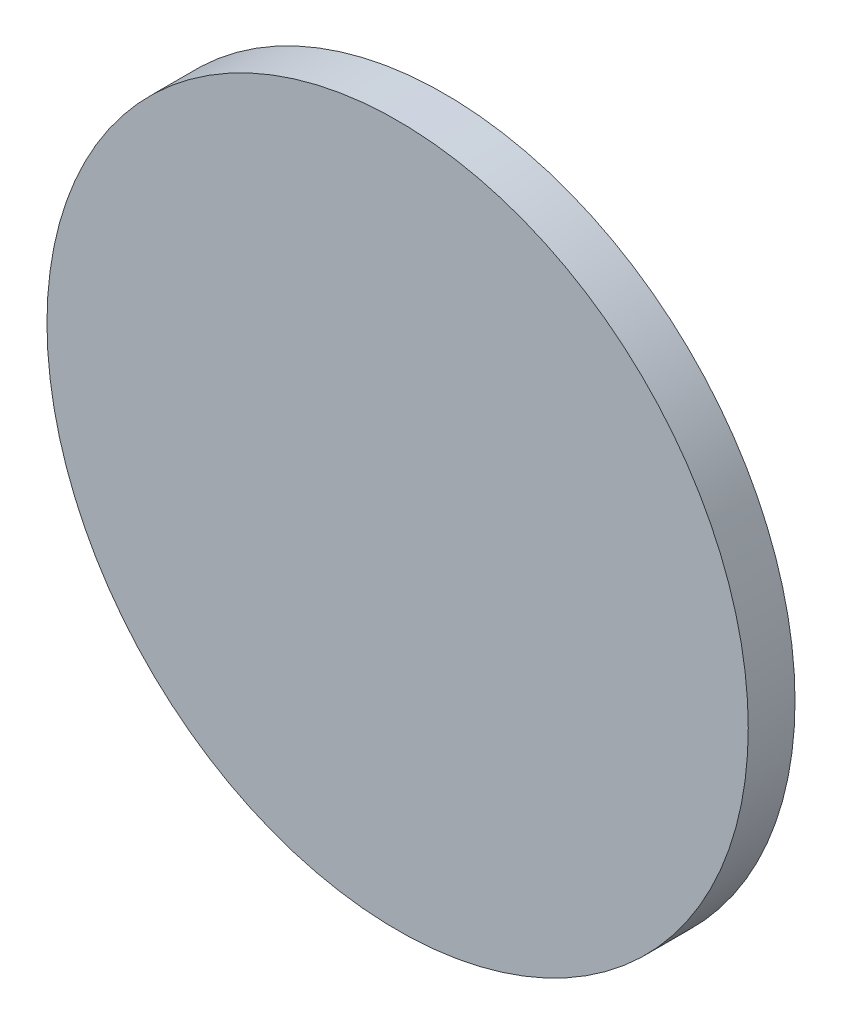
ISO-10303-21;
HEADER;
FILE_DESCRIPTION(('STEP AP214'),'2;1');
FILE_NAME('part.step','',(''),(''),'','','');
FILE_SCHEMA(('AUTOMOTIVE_DESIGN { 1 0 10303 214 1 1 1 1 }'));
ENDSEC;
DATA;
#1=APPLICATION_CONTEXT('core data for automotive mechanical design processes');
#2=APPLICATION_PROTOCOL_DEFINITION('international standard','automotive_design',2000,#1);
#3=PRODUCT_CONTEXT('',#1,'mechanical');
#4=PRODUCT('Part','Part','',(#3));
#5=PRODUCT_RELATED_PRODUCT_CATEGORY('part','',(#4));
#6=PRODUCT_DEFINITION_FORMATION('','',#4);
#7=PRODUCT_DEFINITION_CONTEXT('part definition',#1,'design');
#8=PRODUCT_DEFINITION('design','',#6,#7);
#9=PRODUCT_DEFINITION_SHAPE('','',#8);
#10=(LENGTH_UNIT() NAMED_UNIT(*) SI_UNIT(.MILLI.,.METRE.));
#11=(NAMED_UNIT(*) PLANE_ANGLE_UNIT() SI_UNIT($,.RADIAN.));
#12=(NAMED_UNIT(*) SI_UNIT($,.STERADIAN.) SOLID_ANGLE_UNIT());
#13=UNCERTAINTY_MEASURE_WITH_UNIT(LENGTH_MEASURE(1.E-05),#10,'distance_accuracy_value','');
#14=(GEOMETRIC_REPRESENTATION_CONTEXT(3) GLOBAL_UNCERTAINTY_ASSIGNED_CONTEXT((#13)) GLOBAL_UNIT_ASSIGNED_CONTEXT((#10,
#11,#12)) REPRESENTATION_CONTEXT('',''));
#15=CARTESIAN_POINT('',(0.,0.,0.));
#16=DIRECTION('',(0.,0.,1.));
#17=DIRECTION('',(1.,0.,0.));
#18=AXIS2_PLACEMENT_3D('',#15,#16,#17);
#19=CARTESIAN_POINT('',(0.,0.,5.));
#20=DIRECTION('',(0.,0.,-1.));
#21=DIRECTION('',(-1.,0.,0.));
#22=AXIS2_PLACEMENT_3D('',#19,#20,#21);
#23=CYLINDRICAL_SURFACE('',#22,37.5);
#24=CARTESIAN_POINT('',(0.,0.,5.));
#25=DIRECTION('',(0.,0.,1.));
#26=DIRECTION('',(1.,0.,0.));
#27=AXIS2_PLACEMENT_3D('',#24,#25,#26);
#28=CIRCLE('',#27,37.5);
#29=CARTESIAN_POINT('',(37.5,0.,5.));
#30=VERTEX_POINT('',#29);
#31=EDGE_CURVE('E10',#30,#30,#28,.T.);
#32=ORIENTED_EDGE('',*,*,#31,.F.);
#33=EDGE_LOOP('',(#32));
#34=FACE_BOUND('',#33,.T.);
#35=CARTESIAN_POINT('',(0.,0.,0.));
#36=DIRECTION('',(0.,0.,1.));
#37=DIRECTION('',(1.,0.,0.));
#38=AXIS2_PLACEMENT_3D('',#35,#36,#37);
#39=CIRCLE('',#38,37.5);
#40=CARTESIAN_POINT('',(37.5,0.,0.));
#41=VERTEX_POINT('',#40);
#42=EDGE_CURVE('E44',#41,#41,#39,.T.);
#43=ORIENTED_EDGE('',*,*,#42,.T.);
#44=EDGE_LOOP('',(#43));
#45=FACE_BOUND('',#44,.T.);
#46=ADVANCED_FACE('F41',(#34,#45),#23,.T.);
#47=CARTESIAN_POINT('',(0.,0.,5.));
#48=DIRECTION('',(0.,0.,1.));
#49=DIRECTION('',(1.,0.,0.));
#50=AXIS2_PLACEMENT_3D('',#47,#48,#49);
#51=PLANE('',#50);
#52=ORIENTED_EDGE('',*,*,#31,.T.);
#53=EDGE_LOOP('',(#52));
#54=FACE_BOUND('',#53,.T.);
#55=ADVANCED_FACE('F56',(#54),#51,.T.);
#56=CARTESIAN_POINT('',(0.,0.,0.));
#57=DIRECTION('',(0.,0.,1.));
#58=DIRECTION('',(1.,0.,0.));
#59=AXIS2_PLACEMENT_3D('',#56,#57,#58);
#60=PLANE('',#59);
#61=ORIENTED_EDGE('',*,*,#42,.F.);
#62=EDGE_LOOP('',(#61));
#63=FACE_BOUND('',#62,.T.);
#64=ADVANCED_FACE('F54',(#63),#60,.F.);
#65=CLOSED_SHELL('',(#46,#55,#64));
#66=MANIFOLD_SOLID_BREP('B2',#65);
#67=ADVANCED_BREP_SHAPE_REPRESENTATION('',(#18,#66),#14);
#68=SHAPE_DEFINITION_REPRESENTATION(#9,#67);
ENDSEC;
END-ISO-10303-21;
